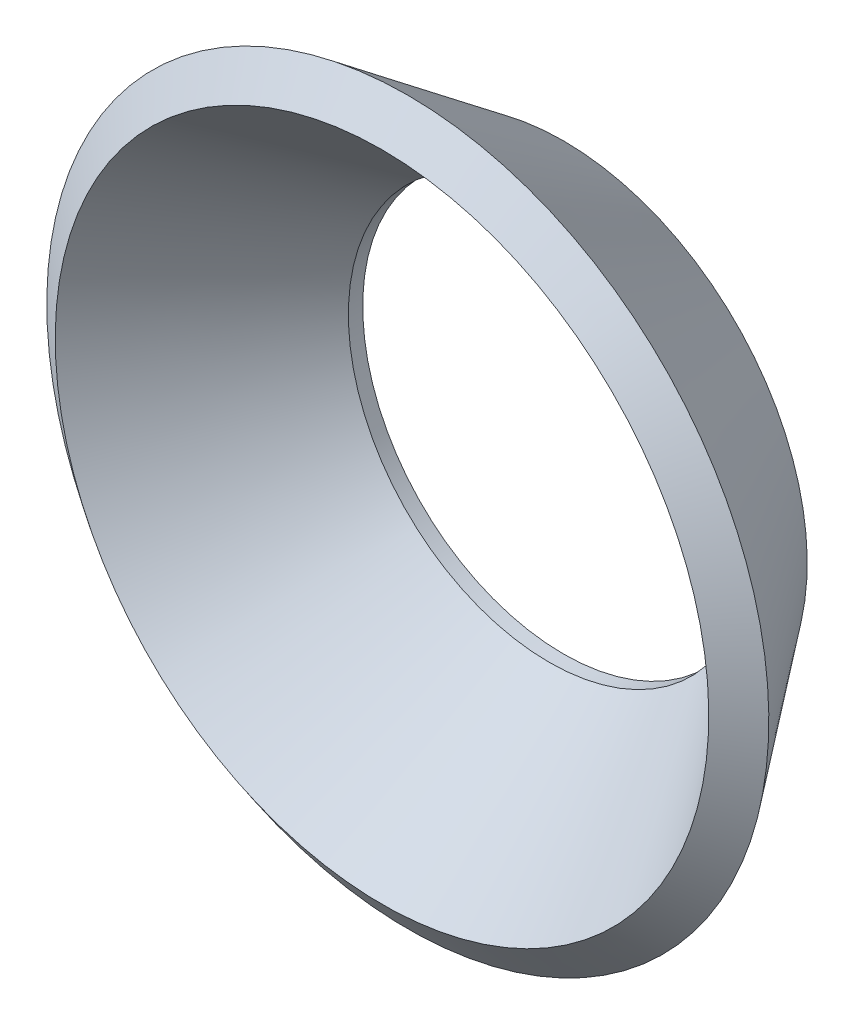
ISO-10303-21;
HEADER;
FILE_DESCRIPTION(('STEP AP214'),'2;1');
FILE_NAME('part.step','',(''),(''),'','','');
FILE_SCHEMA(('AUTOMOTIVE_DESIGN { 1 0 10303 214 1 1 1 1 }'));
ENDSEC;
DATA;
#1=APPLICATION_CONTEXT('core data for automotive mechanical design processes');
#2=APPLICATION_PROTOCOL_DEFINITION('international standard','automotive_design',2000,#1);
#3=PRODUCT_CONTEXT('',#1,'mechanical');
#4=PRODUCT('Part','Part','',(#3));
#5=PRODUCT_RELATED_PRODUCT_CATEGORY('part','',(#4));
#6=PRODUCT_DEFINITION_FORMATION('','',#4);
#7=PRODUCT_DEFINITION_CONTEXT('part definition',#1,'design');
#8=PRODUCT_DEFINITION('design','',#6,#7);
#9=PRODUCT_DEFINITION_SHAPE('','',#8);
#10=(LENGTH_UNIT() NAMED_UNIT(*) SI_UNIT(.MILLI.,.METRE.));
#11=(NAMED_UNIT(*) PLANE_ANGLE_UNIT() SI_UNIT($,.RADIAN.));
#12=(NAMED_UNIT(*) SI_UNIT($,.STERADIAN.) SOLID_ANGLE_UNIT());
#13=UNCERTAINTY_MEASURE_WITH_UNIT(LENGTH_MEASURE(1.E-05),#10,'distance_accuracy_value','');
#14=(GEOMETRIC_REPRESENTATION_CONTEXT(3) GLOBAL_UNCERTAINTY_ASSIGNED_CONTEXT((#13)) GLOBAL_UNIT_ASSIGNED_CONTEXT((#10,
#11,#12)) REPRESENTATION_CONTEXT('',''));
#15=CARTESIAN_POINT('',(0.,0.,0.));
#16=DIRECTION('',(0.,0.,1.));
#17=DIRECTION('',(1.,0.,0.));
#18=AXIS2_PLACEMENT_3D('',#15,#16,#17);
#19=CARTESIAN_POINT('',(-8.88178419700125E-13,2.61620000000007,0.));
#20=DIRECTION('',(0.,0.,-1.));
#21=DIRECTION('',(0.,0.999999999999998,0.));
#22=AXIS2_PLACEMENT_3D('',#19,#20,#21);
#23=PLANE('',#22);
#24=CARTESIAN_POINT('',(0.,0.,0.));
#25=DIRECTION('',(0.,0.,-1.));
#26=DIRECTION('',(0.,0.999999999999998,0.));
#27=AXIS2_PLACEMENT_3D('',#24,#25,#26);
#28=CIRCLE('',#27,3.175);
#29=CARTESIAN_POINT('',(0.,3.17499999999999,0.));
#30=VERTEX_POINT('',#29);
#31=EDGE_CURVE('E45',#30,#30,#28,.T.);
#32=ORIENTED_EDGE('',*,*,#31,.T.);
#33=EDGE_LOOP('',(#32));
#34=FACE_BOUND('',#33,.T.);
#35=CARTESIAN_POINT('',(0.,0.,0.));
#36=DIRECTION('',(0.,0.,-1.));
#37=DIRECTION('',(0.,0.999999999999998,0.));
#38=AXIS2_PLACEMENT_3D('',#35,#36,#37);
#39=CIRCLE('',#38,2.6162);
#40=CARTESIAN_POINT('',(0.,2.6162,0.));
#41=VERTEX_POINT('',#40);
#42=EDGE_CURVE('E10',#41,#41,#39,.T.);
#43=ORIENTED_EDGE('',*,*,#42,.F.);
#44=EDGE_LOOP('',(#43));
#45=FACE_BOUND('',#44,.T.);
#46=ADVANCED_FACE('F26',(#34,#45),#23,.T.);
#47=CARTESIAN_POINT('',(0.,0.,0.));
#48=DIRECTION('',(0.,0.,-1.));
#49=DIRECTION('',(0.,0.999999999999998,0.));
#50=AXIS2_PLACEMENT_3D('',#47,#48,#49);
#51=CYLINDRICAL_SURFACE('',#50,2.6162);
#52=ORIENTED_EDGE('',*,*,#42,.T.);
#53=EDGE_LOOP('',(#52));
#54=FACE_BOUND('',#53,.T.);
#55=CARTESIAN_POINT('',(0.,0.,0.186971864537755));
#56=DIRECTION('',(0.,0.,-1.));
#57=DIRECTION('',(0.,0.999999999999998,0.));
#58=AXIS2_PLACEMENT_3D('',#55,#56,#57);
#59=CIRCLE('',#58,2.6162);
#60=CARTESIAN_POINT('',(0.,2.6162,0.186971864537755));
#61=VERTEX_POINT('',#60);
#62=EDGE_CURVE('E32',#61,#61,#59,.T.);
#63=ORIENTED_EDGE('',*,*,#62,.F.);
#64=EDGE_LOOP('',(#63));
#65=FACE_BOUND('',#64,.T.);
#66=ADVANCED_FACE('F63',(#54,#65),#51,.F.);
#67=CARTESIAN_POINT('',(-4.44089209850063E-13,0.,2.36482843045749));
#68=DIRECTION('',(0.,0.,1.));
#69=DIRECTION('',(0.,-0.999999999999998,0.));
#70=AXIS2_PLACEMENT_3D('',#67,#68,#69);
#71=CONICAL_SURFACE('',#70,4.25733263579178,0.645771823237903);
#72=ORIENTED_EDGE('',*,*,#62,.T.);
#73=EDGE_LOOP('',(#72));
#74=FACE_BOUND('',#73,.T.);
#75=CARTESIAN_POINT('',(-4.44089209850063E-13,0.,2.36482843045749));
#76=DIRECTION('',(0.,0.,-1.));
#77=DIRECTION('',(0.,0.999999999999998,0.));
#78=AXIS2_PLACEMENT_3D('',#75,#76,#77);
#79=CIRCLE('',#78,4.25733263579178);
#80=CARTESIAN_POINT('',(-4.44148292209009E-13,4.25733263579177,2.36482843045749));
#81=VERTEX_POINT('',#80);
#82=EDGE_CURVE('E36',#81,#81,#79,.T.);
#83=ORIENTED_EDGE('',*,*,#82,.F.);
#84=EDGE_LOOP('',(#83));
#85=FACE_BOUND('',#84,.T.);
#86=ADVANCED_FACE('F59',(#74,#85),#71,.F.);
#87=CARTESIAN_POINT('',(-4.44089209850063E-13,0.,2.02853419552051));
#88=DIRECTION('',(0.,0.,-1.));
#89=DIRECTION('',(0.,0.999999999999998,0.));
#90=AXIS2_PLACEMENT_3D('',#87,#88,#89);
#91=CONICAL_SURFACE('',#90,4.70361015880621,0.925024503556993);
#92=ORIENTED_EDGE('',*,*,#82,.T.);
#93=EDGE_LOOP('',(#92));
#94=FACE_BOUND('',#93,.T.);
#95=CARTESIAN_POINT('',(-4.44089209850063E-13,0.,2.02853419552051));
#96=DIRECTION('',(0.,0.,-1.));
#97=DIRECTION('',(0.,0.999999999999998,0.));
#98=AXIS2_PLACEMENT_3D('',#95,#96,#97);
#99=CIRCLE('',#98,4.70361015880621);
#100=CARTESIAN_POINT('',(-4.44154485553777E-13,4.7036101588062,2.02853419552052));
#101=VERTEX_POINT('',#100);
#102=EDGE_CURVE('E40',#101,#101,#99,.T.);
#103=ORIENTED_EDGE('',*,*,#102,.F.);
#104=EDGE_LOOP('',(#103));
#105=FACE_BOUND('',#104,.T.);
#106=ADVANCED_FACE('F53',(#94,#105),#91,.T.);
#107=CARTESIAN_POINT('',(0.,0.,0.));
#108=DIRECTION('',(0.,0.,1.));
#109=DIRECTION('',(0.,-0.999999999999998,0.));
#110=AXIS2_PLACEMENT_3D('',#107,#108,#109);
#111=CONICAL_SURFACE('',#110,3.175,0.645771823237904);
#112=ORIENTED_EDGE('',*,*,#102,.T.);
#113=EDGE_LOOP('',(#112));
#114=FACE_BOUND('',#113,.T.);
#115=ORIENTED_EDGE('',*,*,#31,.F.);
#116=EDGE_LOOP('',(#115));
#117=FACE_BOUND('',#116,.T.);
#118=ADVANCED_FACE('F51',(#114,#117),#111,.T.);
#119=CLOSED_SHELL('',(#46,#66,#86,#106,#118));
#120=MANIFOLD_SOLID_BREP('B2',#119);
#121=ADVANCED_BREP_SHAPE_REPRESENTATION('',(#18,#120),#14);
#122=SHAPE_DEFINITION_REPRESENTATION(#9,#121);
ENDSEC;
END-ISO-10303-21;
